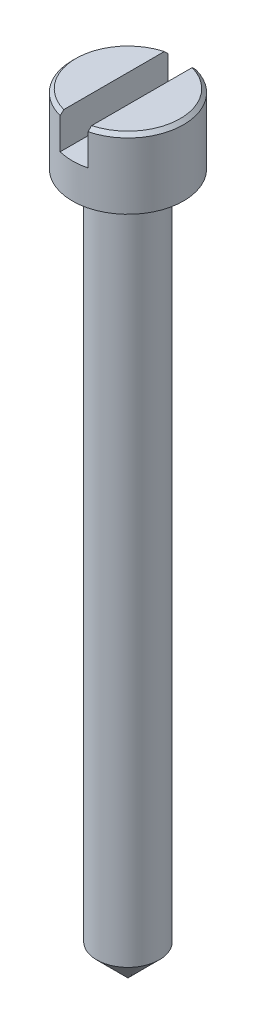
ISO-10303-21;
HEADER;
FILE_DESCRIPTION(('STEP AP214'),'2;1');
FILE_NAME('part.step','',(''),(''),'','','');
FILE_SCHEMA(('AUTOMOTIVE_DESIGN { 1 0 10303 214 1 1 1 1 }'));
ENDSEC;
DATA;
#1=APPLICATION_CONTEXT('core data for automotive mechanical design processes');
#2=APPLICATION_PROTOCOL_DEFINITION('international standard','automotive_design',2000,#1);
#3=PRODUCT_CONTEXT('',#1,'mechanical');
#4=PRODUCT('Part','Part','',(#3));
#5=PRODUCT_RELATED_PRODUCT_CATEGORY('part','',(#4));
#6=PRODUCT_DEFINITION_FORMATION('','',#4);
#7=PRODUCT_DEFINITION_CONTEXT('part definition',#1,'design');
#8=PRODUCT_DEFINITION('design','',#6,#7);
#9=PRODUCT_DEFINITION_SHAPE('','',#8);
#10=(LENGTH_UNIT() NAMED_UNIT(*) SI_UNIT(.MILLI.,.METRE.));
#11=(NAMED_UNIT(*) PLANE_ANGLE_UNIT() SI_UNIT($,.RADIAN.));
#12=(NAMED_UNIT(*) SI_UNIT($,.STERADIAN.) SOLID_ANGLE_UNIT());
#13=UNCERTAINTY_MEASURE_WITH_UNIT(LENGTH_MEASURE(1.E-05),#10,'distance_accuracy_value','');
#14=(GEOMETRIC_REPRESENTATION_CONTEXT(3) GLOBAL_UNCERTAINTY_ASSIGNED_CONTEXT((#13)) GLOBAL_UNIT_ASSIGNED_CONTEXT((#10,
#11,#12)) REPRESENTATION_CONTEXT('',''));
#15=CARTESIAN_POINT('',(0.,0.,0.));
#16=DIRECTION('',(0.,0.,1.));
#17=DIRECTION('',(1.,0.,0.));
#18=AXIS2_PLACEMENT_3D('',#15,#16,#17);
#19=CARTESIAN_POINT('',(0.,221.5,0.));
#20=DIRECTION('',(0.,-1.,0.));
#21=DIRECTION('',(0.,0.,-1.));
#22=AXIS2_PLACEMENT_3D('',#19,#20,#21);
#23=PLANE('',#22);
#24=DIRECTION('',(0.,0.,1.));
#25=VECTOR('',#24,1.);
#26=CARTESIAN_POINT('',(-4.00000000000003,221.5,-16.));
#27=LINE('',#26,#25);
#28=CARTESIAN_POINT('',(-4.00000000000003,221.5,-14.4568322948009));
#29=VERTEX_POINT('',#28);
#30=CARTESIAN_POINT('',(-4.00000000000003,221.5,14.4568322948009));
#31=VERTEX_POINT('',#30);
#32=EDGE_CURVE('E134',#29,#31,#27,.T.);
#33=ORIENTED_EDGE('',*,*,#32,.F.);
#34=CARTESIAN_POINT('',(0.,221.5,0.));
#35=DIRECTION('',(0.,-1.,0.));
#36=DIRECTION('',(0.,0.,-1.));
#37=AXIS2_PLACEMENT_3D('',#34,#35,#36);
#38=CIRCLE('',#37,15.);
#39=EDGE_CURVE('E125',#29,#31,#38,.F.);
#40=ORIENTED_EDGE('',*,*,#39,.T.);
#41=EDGE_LOOP('',(#33,#40));
#42=FACE_BOUND('',#41,.T.);
#43=ADVANCED_FACE('F45',(#42),#23,.F.);
#44=DIRECTION('',(0.,0.,1.));
#45=VECTOR('',#44,1.);
#46=CARTESIAN_POINT('',(3.99999999999997,221.5,-16.));
#47=LINE('',#46,#45);
#48=CARTESIAN_POINT('',(3.99999999999997,221.5,-14.4568322948009));
#49=VERTEX_POINT('',#48);
#50=CARTESIAN_POINT('',(3.99999999999997,221.5,14.4568322948009));
#51=VERTEX_POINT('',#50);
#52=EDGE_CURVE('E131',#49,#51,#47,.T.);
#53=ORIENTED_EDGE('',*,*,#52,.T.);
#54=CARTESIAN_POINT('',(0.,221.5,0.));
#55=DIRECTION('',(0.,-1.,0.));
#56=DIRECTION('',(0.,0.,-1.));
#57=AXIS2_PLACEMENT_3D('',#54,#55,#56);
#58=CIRCLE('',#57,15.);
#59=EDGE_CURVE('E208',#51,#49,#58,.F.);
#60=ORIENTED_EDGE('',*,*,#59,.T.);
#61=EDGE_LOOP('',(#53,#60));
#62=FACE_BOUND('',#61,.T.);
#63=ADVANCED_FACE('F187',(#62),#23,.F.);
#64=CARTESIAN_POINT('',(0.,0.,0.));
#65=DIRECTION('',(0.,1.,0.));
#66=DIRECTION('',(0.,0.,1.));
#67=AXIS2_PLACEMENT_3D('',#64,#65,#66);
#68=CYLINDRICAL_SURFACE('',#67,16.);
#69=DIRECTION('',(0.,1.,0.));
#70=VECTOR('',#69,1.);
#71=CARTESIAN_POINT('',(-4.00000000000003,0.,15.4919333848296));
#72=LINE('',#71,#70);
#73=CARTESIAN_POINT('',(-4.00000000000003,211.5,15.4919333848296));
#74=VERTEX_POINT('',#73);
#75=CARTESIAN_POINT('',(-4.00000000000003,220.5,15.4919333848296));
#76=VERTEX_POINT('',#75);
#77=EDGE_CURVE('E119',#74,#76,#72,.T.);
#78=ORIENTED_EDGE('',*,*,#77,.T.);
#79=CARTESIAN_POINT('',(0.,220.5,0.));
#80=DIRECTION('',(0.,-1.,0.));
#81=DIRECTION('',(0.,0.,-1.));
#82=AXIS2_PLACEMENT_3D('',#79,#80,#81);
#83=CIRCLE('',#82,16.);
#84=CARTESIAN_POINT('',(-4.00000000000003,220.5,-15.4919333848296));
#85=VERTEX_POINT('',#84);
#86=EDGE_CURVE('E206',#76,#85,#83,.T.);
#87=ORIENTED_EDGE('',*,*,#86,.T.);
#88=DIRECTION('',(0.,1.,0.));
#89=VECTOR('',#88,1.);
#90=CARTESIAN_POINT('',(-4.00000000000003,0.,-15.4919333848296));
#91=LINE('',#90,#89);
#92=CARTESIAN_POINT('',(-4.00000000000003,211.5,-15.4919333848296));
#93=VERTEX_POINT('',#92);
#94=EDGE_CURVE('E114',#85,#93,#91,.F.);
#95=ORIENTED_EDGE('',*,*,#94,.T.);
#96=CARTESIAN_POINT('',(0.,211.5,0.));
#97=DIRECTION('',(0.,-1.,0.));
#98=DIRECTION('',(0.,0.,-1.));
#99=AXIS2_PLACEMENT_3D('',#96,#97,#98);
#100=CIRCLE('',#99,16.);
#101=CARTESIAN_POINT('',(3.99999999999997,211.5,-15.4919333848296));
#102=VERTEX_POINT('',#101);
#103=EDGE_CURVE('E107',#93,#102,#100,.T.);
#104=ORIENTED_EDGE('',*,*,#103,.T.);
#105=DIRECTION('',(0.,1.,0.));
#106=VECTOR('',#105,1.);
#107=CARTESIAN_POINT('',(3.99999999999997,0.,-15.4919333848296));
#108=LINE('',#107,#106);
#109=CARTESIAN_POINT('',(3.99999999999997,220.5,-15.4919333848296));
#110=VERTEX_POINT('',#109);
#111=EDGE_CURVE('E112',#102,#110,#108,.T.);
#112=ORIENTED_EDGE('',*,*,#111,.T.);
#113=CARTESIAN_POINT('',(0.,220.5,0.));
#114=DIRECTION('',(0.,-1.,0.));
#115=DIRECTION('',(0.,0.,-1.));
#116=AXIS2_PLACEMENT_3D('',#113,#114,#115);
#117=CIRCLE('',#116,16.);
#118=CARTESIAN_POINT('',(3.99999999999997,220.5,15.4919333848296));
#119=VERTEX_POINT('',#118);
#120=EDGE_CURVE('E207',#110,#119,#117,.T.);
#121=ORIENTED_EDGE('',*,*,#120,.T.);
#122=DIRECTION('',(0.,1.,0.));
#123=VECTOR('',#122,1.);
#124=CARTESIAN_POINT('',(3.99999999999997,0.,15.4919333848296));
#125=LINE('',#124,#123);
#126=CARTESIAN_POINT('',(3.99999999999997,211.5,15.4919333848296));
#127=VERTEX_POINT('',#126);
#128=EDGE_CURVE('E126',#119,#127,#125,.F.);
#129=ORIENTED_EDGE('',*,*,#128,.T.);
#130=EDGE_CURVE('E121',#127,#74,#100,.T.);
#131=ORIENTED_EDGE('',*,*,#130,.T.);
#132=EDGE_LOOP('',(#78,#87,#95,#104,#112,#121,#129,#131));
#133=FACE_BOUND('',#132,.T.);
#134=CARTESIAN_POINT('',(0.,201.5,0.));
#135=DIRECTION('',(0.,1.,0.));
#136=DIRECTION('',(0.,0.,1.));
#137=AXIS2_PLACEMENT_3D('',#134,#135,#136);
#138=CIRCLE('',#137,16.);
#139=CARTESIAN_POINT('',(0.,201.5,16.));
#140=VERTEX_POINT('',#139);
#141=EDGE_CURVE('E142',#140,#140,#138,.T.);
#142=ORIENTED_EDGE('',*,*,#141,.T.);
#143=EDGE_LOOP('',(#142));
#144=FACE_BOUND('',#143,.T.);
#145=ADVANCED_FACE('F110',(#133,#144),#68,.T.);
#146=CARTESIAN_POINT('',(16.,201.5,0.));
#147=DIRECTION('',(0.,1.,0.));
#148=DIRECTION('',(0.,0.,1.));
#149=AXIS2_PLACEMENT_3D('',#146,#147,#148);
#150=PLANE('',#149);
#151=ORIENTED_EDGE('',*,*,#141,.F.);
#152=EDGE_LOOP('',(#151));
#153=FACE_BOUND('',#152,.T.);
#154=CARTESIAN_POINT('',(0.,201.5,0.));
#155=DIRECTION('',(0.,1.,0.));
#156=DIRECTION('',(0.,0.,1.));
#157=AXIS2_PLACEMENT_3D('',#154,#155,#156);
#158=CIRCLE('',#157,8.99999999999998);
#159=CARTESIAN_POINT('',(0.,201.5,8.99999999999998));
#160=VERTEX_POINT('',#159);
#161=EDGE_CURVE('E139',#160,#160,#158,.T.);
#162=ORIENTED_EDGE('',*,*,#161,.T.);
#163=EDGE_LOOP('',(#162));
#164=FACE_BOUND('',#163,.T.);
#165=ADVANCED_FACE('F180',(#153,#164),#150,.F.);
#166=CARTESIAN_POINT('',(0.,0.,0.));
#167=DIRECTION('',(0.,1.,0.));
#168=DIRECTION('',(0.,0.,1.));
#169=AXIS2_PLACEMENT_3D('',#166,#167,#168);
#170=CYLINDRICAL_SURFACE('',#169,8.99999999999999);
#171=CARTESIAN_POINT('',(0.,8.99999999999998,0.));
#172=DIRECTION('',(0.,1.,0.));
#173=DIRECTION('',(0.,0.,1.));
#174=AXIS2_PLACEMENT_3D('',#171,#172,#173);
#175=CIRCLE('',#174,8.99999999999999);
#176=CARTESIAN_POINT('',(0.,8.99999999999998,8.99999999999999));
#177=VERTEX_POINT('',#176);
#178=EDGE_CURVE('E145',#177,#177,#175,.T.);
#179=ORIENTED_EDGE('',*,*,#178,.T.);
#180=EDGE_LOOP('',(#179));
#181=FACE_BOUND('',#180,.T.);
#182=ORIENTED_EDGE('',*,*,#161,.F.);
#183=EDGE_LOOP('',(#182));
#184=FACE_BOUND('',#183,.T.);
#185=ADVANCED_FACE('F176',(#181,#184),#170,.T.);
#186=CARTESIAN_POINT('',(0.,8.99999999999998,0.));
#187=DIRECTION('',(0.,1.,0.));
#188=DIRECTION('',(0.,0.,1.));
#189=AXIS2_PLACEMENT_3D('',#186,#187,#188);
#190=CONICAL_SURFACE('',#189,9.00000000000001,0.78539816339745);
#191=CARTESIAN_POINT('',(0.,0.,0.));
#192=VERTEX_POINT('',#191);
#193=VERTEX_LOOP('',#192);
#194=FACE_BOUND('',#193,.T.);
#195=ORIENTED_EDGE('',*,*,#178,.F.);
#196=EDGE_LOOP('',(#195));
#197=FACE_BOUND('',#196,.T.);
#198=ADVANCED_FACE('F174',(#194,#197),#190,.T.);
#199=CARTESIAN_POINT('',(-4.00000000000003,221.5,-16.));
#200=DIRECTION('',(-1.,0.,0.));
#201=DIRECTION('',(0.,0.,1.));
#202=AXIS2_PLACEMENT_3D('',#199,#200,#201);
#203=PLANE('',#202);
#204=ORIENTED_EDGE('',*,*,#32,.T.);
#205=CARTESIAN_POINT('',(-4.00000000000003,221.5,14.4568322948009));
#206=CARTESIAN_POINT('',(-4.00000000000003,221.33353198143,14.6295410584893));
#207=CARTESIAN_POINT('',(-4.00000000000003,221.166964637919,14.8021538654238));
#208=CARTESIAN_POINT('',(-4.00000000000003,220.833631304582,15.147187562096));
#209=CARTESIAN_POINT('',(-4.00000000000003,220.666865314759,15.3196084518376));
#210=CARTESIAN_POINT('',(-4.00000000000003,220.5,15.4919333848296));
#211=B_SPLINE_CURVE_WITH_KNOTS('',3,(#205,#206,#207,#208,#209,#210),.UNSPECIFIED.,.F.,.F.,(4,2,
4),(0.,0.719624033352213,1.43924805131424),.UNSPECIFIED.);
#212=EDGE_CURVE('E160',#31,#76,#211,.T.);
#213=ORIENTED_EDGE('',*,*,#212,.T.);
#214=ORIENTED_EDGE('',*,*,#77,.F.);
#215=DIRECTION('',(0.,0.,1.));
#216=VECTOR('',#215,1.);
#217=CARTESIAN_POINT('',(-4.00000000000003,211.5,-16.));
#218=LINE('',#217,#216);
#219=EDGE_CURVE('E132',#93,#74,#218,.T.);
#220=ORIENTED_EDGE('',*,*,#219,.F.);
#221=ORIENTED_EDGE('',*,*,#94,.F.);
#222=CARTESIAN_POINT('',(-4.00000000000003,220.5,-15.4919333848296));
#223=CARTESIAN_POINT('',(-4.00000000000003,220.666865314759,-15.3196084518376));
#224=CARTESIAN_POINT('',(-4.00000000000003,220.833631304582,-15.147187562096));
#225=CARTESIAN_POINT('',(-4.00000000000003,221.166964637919,-14.8021538654238));
#226=CARTESIAN_POINT('',(-4.00000000000003,221.33353198143,-14.6295410584893));
#227=CARTESIAN_POINT('',(-4.00000000000003,221.5,-14.4568322948009));
#228=B_SPLINE_CURVE_WITH_KNOTS('',3,(#222,#223,#224,#225,#226,#227),.UNSPECIFIED.,.F.,.F.,(4,2,
4),(0.,0.719624017962021,1.43924805131424),.UNSPECIFIED.);
#229=EDGE_CURVE('E153',#85,#29,#228,.T.);
#230=ORIENTED_EDGE('',*,*,#229,.T.);
#231=EDGE_LOOP('',(#204,#213,#214,#220,#221,#230));
#232=FACE_BOUND('',#231,.T.);
#233=ADVANCED_FACE('F169',(#232),#203,.F.);
#234=CARTESIAN_POINT('',(3.99999999999997,221.5,-16.));
#235=DIRECTION('',(1.,0.,0.));
#236=DIRECTION('',(0.,0.,-1.));
#237=AXIS2_PLACEMENT_3D('',#234,#235,#236);
#238=PLANE('',#237);
#239=ORIENTED_EDGE('',*,*,#52,.F.);
#240=CARTESIAN_POINT('',(3.99999999999997,221.5,-14.4568322948009));
#241=CARTESIAN_POINT('',(3.99999999999997,221.33353198143,-14.6295410584893));
#242=CARTESIAN_POINT('',(3.99999999999997,221.166964637919,-14.8021538654239));
#243=CARTESIAN_POINT('',(3.99999999999997,220.833631304582,-15.147187562096));
#244=CARTESIAN_POINT('',(3.99999999999997,220.666865314759,-15.3196084518376));
#245=CARTESIAN_POINT('',(3.99999999999997,220.5,-15.4919333848296));
#246=B_SPLINE_CURVE_WITH_KNOTS('',3,(#240,#241,#242,#243,#244,#245),.UNSPECIFIED.,.F.,.F.,(4,2,
4),(0.,0.719624033352209,1.43924805131422),.UNSPECIFIED.);
#247=EDGE_CURVE('E11',#49,#110,#246,.T.);
#248=ORIENTED_EDGE('',*,*,#247,.T.);
#249=ORIENTED_EDGE('',*,*,#111,.F.);
#250=DIRECTION('',(0.,0.,1.));
#251=VECTOR('',#250,1.);
#252=CARTESIAN_POINT('',(3.99999999999997,211.5,-16.));
#253=LINE('',#252,#251);
#254=EDGE_CURVE('E124',#102,#127,#253,.T.);
#255=ORIENTED_EDGE('',*,*,#254,.T.);
#256=ORIENTED_EDGE('',*,*,#128,.F.);
#257=CARTESIAN_POINT('',(3.99999999999997,220.5,15.4919333848296));
#258=CARTESIAN_POINT('',(3.99999999999997,220.666865314759,15.3196084518376));
#259=CARTESIAN_POINT('',(3.99999999999997,220.833631304582,15.147187562096));
#260=CARTESIAN_POINT('',(3.99999999999997,221.166964637919,14.8021538654239));
#261=CARTESIAN_POINT('',(3.99999999999997,221.33353198143,14.6295410584893));
#262=CARTESIAN_POINT('',(3.99999999999997,221.5,14.4568322948009));
#263=B_SPLINE_CURVE_WITH_KNOTS('',3,(#257,#258,#259,#260,#261,#262),.UNSPECIFIED.,.F.,.F.,(4,2,
4),(0.,0.719624017962019,1.43924805131423),.UNSPECIFIED.);
#264=EDGE_CURVE('E59',#119,#51,#263,.T.);
#265=ORIENTED_EDGE('',*,*,#264,.T.);
#266=EDGE_LOOP('',(#239,#248,#249,#255,#256,#265));
#267=FACE_BOUND('',#266,.T.);
#268=ADVANCED_FACE('F123',(#267),#238,.F.);
#269=CARTESIAN_POINT('',(-4.00000000000003,211.5,-16.));
#270=DIRECTION('',(0.,-1.,0.));
#271=DIRECTION('',(0.,0.,-1.));
#272=AXIS2_PLACEMENT_3D('',#269,#270,#271);
#273=PLANE('',#272);
#274=ORIENTED_EDGE('',*,*,#254,.F.);
#275=ORIENTED_EDGE('',*,*,#103,.F.);
#276=ORIENTED_EDGE('',*,*,#219,.T.);
#277=ORIENTED_EDGE('',*,*,#130,.F.);
#278=EDGE_LOOP('',(#274,#275,#276,#277));
#279=FACE_BOUND('',#278,.T.);
#280=ADVANCED_FACE('F129',(#279),#273,.F.);
#281=CARTESIAN_POINT('',(0.,221.5,0.));
#282=DIRECTION('',(0.,-1.,0.));
#283=DIRECTION('',(0.,0.,-1.));
#284=AXIS2_PLACEMENT_3D('',#281,#282,#283);
#285=CONICAL_SURFACE('',#284,15.,0.785398163397441);
#286=ORIENTED_EDGE('',*,*,#229,.F.);
#287=ORIENTED_EDGE('',*,*,#86,.F.);
#288=ORIENTED_EDGE('',*,*,#212,.F.);
#289=ORIENTED_EDGE('',*,*,#39,.F.);
#290=EDGE_LOOP('',(#286,#287,#288,#289));
#291=FACE_BOUND('',#290,.T.);
#292=ADVANCED_FACE('F166',(#291),#285,.T.);
#293=CARTESIAN_POINT('',(0.,221.5,0.));
#294=DIRECTION('',(0.,-1.,0.));
#295=DIRECTION('',(0.,0.,-1.));
#296=AXIS2_PLACEMENT_3D('',#293,#294,#295);
#297=CONICAL_SURFACE('',#296,15.,0.785398163397441);
#298=ORIENTED_EDGE('',*,*,#264,.F.);
#299=ORIENTED_EDGE('',*,*,#120,.F.);
#300=ORIENTED_EDGE('',*,*,#247,.F.);
#301=ORIENTED_EDGE('',*,*,#59,.F.);
#302=EDGE_LOOP('',(#298,#299,#300,#301));
#303=FACE_BOUND('',#302,.T.);
#304=ADVANCED_FACE('F47',(#303),#297,.T.);
#305=CLOSED_SHELL('',(#43,#63,#145,#165,#185,#198,#233,#268,#280,#292,#304));
#306=MANIFOLD_SOLID_BREP('B2',#305);
#307=ADVANCED_BREP_SHAPE_REPRESENTATION('',(#18,#306),#14);
#308=SHAPE_DEFINITION_REPRESENTATION(#9,#307);
ENDSEC;
END-ISO-10303-21;
